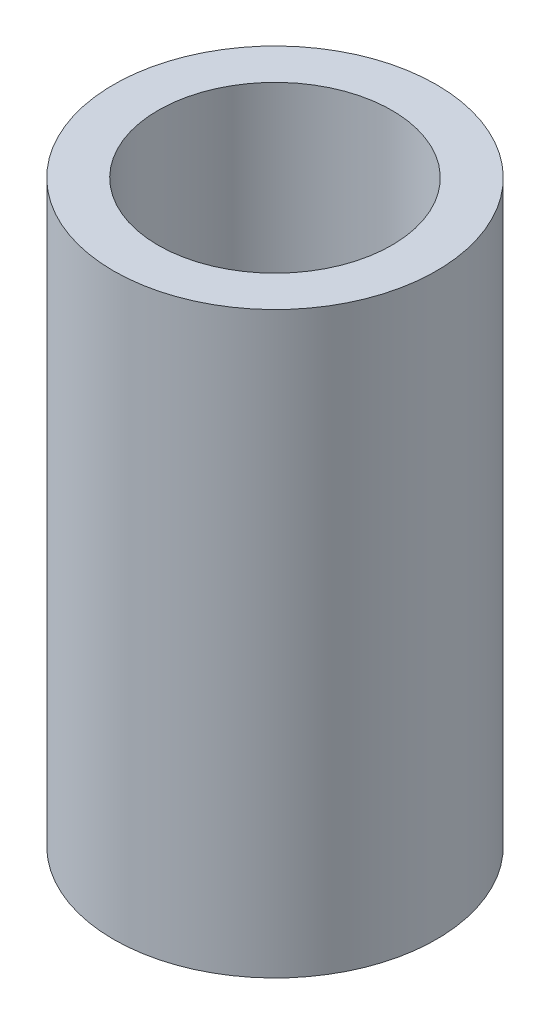
ISO-10303-21;
HEADER;
FILE_DESCRIPTION(('STEP AP214'),'2;1');
FILE_NAME('part.step','',(''),(''),'','','');
FILE_SCHEMA(('AUTOMOTIVE_DESIGN { 1 0 10303 214 1 1 1 1 }'));
ENDSEC;
DATA;
#1=APPLICATION_CONTEXT('core data for automotive mechanical design processes');
#2=APPLICATION_PROTOCOL_DEFINITION('international standard','automotive_design',2000,#1);
#3=PRODUCT_CONTEXT('',#1,'mechanical');
#4=PRODUCT('Part','Part','',(#3));
#5=PRODUCT_RELATED_PRODUCT_CATEGORY('part','',(#4));
#6=PRODUCT_DEFINITION_FORMATION('','',#4);
#7=PRODUCT_DEFINITION_CONTEXT('part definition',#1,'design');
#8=PRODUCT_DEFINITION('design','',#6,#7);
#9=PRODUCT_DEFINITION_SHAPE('','',#8);
#10=(LENGTH_UNIT() NAMED_UNIT(*) SI_UNIT(.MILLI.,.METRE.));
#11=(NAMED_UNIT(*) PLANE_ANGLE_UNIT() SI_UNIT($,.RADIAN.));
#12=(NAMED_UNIT(*) SI_UNIT($,.STERADIAN.) SOLID_ANGLE_UNIT());
#13=UNCERTAINTY_MEASURE_WITH_UNIT(LENGTH_MEASURE(1.E-05),#10,'distance_accuracy_value','');
#14=(GEOMETRIC_REPRESENTATION_CONTEXT(3) GLOBAL_UNCERTAINTY_ASSIGNED_CONTEXT((#13)) GLOBAL_UNIT_ASSIGNED_CONTEXT((#10,
#11,#12)) REPRESENTATION_CONTEXT('',''));
#15=CARTESIAN_POINT('',(0.,0.,0.));
#16=DIRECTION('',(0.,0.,1.));
#17=DIRECTION('',(1.,0.,0.));
#18=AXIS2_PLACEMENT_3D('',#15,#16,#17);
#19=CARTESIAN_POINT('',(0.,26.,0.));
#20=DIRECTION('',(0.,1.,0.));
#21=DIRECTION('',(0.,0.,1.));
#22=AXIS2_PLACEMENT_3D('',#19,#20,#21);
#23=PLANE('',#22);
#24=CARTESIAN_POINT('',(0.,26.,0.));
#25=DIRECTION('',(0.,1.,0.));
#26=DIRECTION('',(0.,0.,1.));
#27=AXIS2_PLACEMENT_3D('',#24,#25,#26);
#28=CIRCLE('',#27,7.25);
#29=CARTESIAN_POINT('',(0.,26.,7.25));
#30=VERTEX_POINT('',#29);
#31=EDGE_CURVE('E10',#30,#30,#28,.T.);
#32=ORIENTED_EDGE('',*,*,#31,.T.);
#33=EDGE_LOOP('',(#32));
#34=FACE_BOUND('',#33,.T.);
#35=CARTESIAN_POINT('',(0.,26.,0.));
#36=DIRECTION('',(0.,1.,0.));
#37=DIRECTION('',(0.,0.,1.));
#38=AXIS2_PLACEMENT_3D('',#35,#36,#37);
#39=CIRCLE('',#38,5.25);
#40=CARTESIAN_POINT('',(0.,26.,5.25));
#41=VERTEX_POINT('',#40);
#42=EDGE_CURVE('E41',#41,#41,#39,.T.);
#43=ORIENTED_EDGE('',*,*,#42,.F.);
#44=EDGE_LOOP('',(#43));
#45=FACE_BOUND('',#44,.T.);
#46=ADVANCED_FACE('F30',(#34,#45),#23,.T.);
#47=CARTESIAN_POINT('',(0.,0.,0.));
#48=DIRECTION('',(0.,1.,0.));
#49=DIRECTION('',(0.,0.,1.));
#50=AXIS2_PLACEMENT_3D('',#47,#48,#49);
#51=PLANE('',#50);
#52=CARTESIAN_POINT('',(0.,0.,0.));
#53=DIRECTION('',(0.,1.,0.));
#54=DIRECTION('',(0.,0.,1.));
#55=AXIS2_PLACEMENT_3D('',#52,#53,#54);
#56=CIRCLE('',#55,7.25);
#57=CARTESIAN_POINT('',(0.,0.,7.25));
#58=VERTEX_POINT('',#57);
#59=EDGE_CURVE('E34',#58,#58,#56,.T.);
#60=ORIENTED_EDGE('',*,*,#59,.F.);
#61=EDGE_LOOP('',(#60));
#62=FACE_BOUND('',#61,.T.);
#63=CARTESIAN_POINT('',(0.,0.,0.));
#64=DIRECTION('',(0.,1.,0.));
#65=DIRECTION('',(0.,0.,1.));
#66=AXIS2_PLACEMENT_3D('',#63,#64,#65);
#67=CIRCLE('',#66,5.25);
#68=CARTESIAN_POINT('',(0.,0.,5.25));
#69=VERTEX_POINT('',#68);
#70=EDGE_CURVE('E43',#69,#69,#67,.T.);
#71=ORIENTED_EDGE('',*,*,#70,.T.);
#72=EDGE_LOOP('',(#71));
#73=FACE_BOUND('',#72,.T.);
#74=ADVANCED_FACE('F53',(#62,#73),#51,.F.);
#75=CARTESIAN_POINT('',(0.,26.,0.));
#76=DIRECTION('',(0.,-1.,0.));
#77=DIRECTION('',(0.,0.,-1.));
#78=AXIS2_PLACEMENT_3D('',#75,#76,#77);
#79=CYLINDRICAL_SURFACE('',#78,7.25);
#80=ORIENTED_EDGE('',*,*,#31,.F.);
#81=EDGE_LOOP('',(#80));
#82=FACE_BOUND('',#81,.T.);
#83=ORIENTED_EDGE('',*,*,#59,.T.);
#84=EDGE_LOOP('',(#83));
#85=FACE_BOUND('',#84,.T.);
#86=ADVANCED_FACE('F32',(#82,#85),#79,.T.);
#87=CARTESIAN_POINT('',(0.,26.,0.));
#88=DIRECTION('',(0.,-1.,0.));
#89=DIRECTION('',(0.,0.,-1.));
#90=AXIS2_PLACEMENT_3D('',#87,#88,#89);
#91=CYLINDRICAL_SURFACE('',#90,5.25);
#92=ORIENTED_EDGE('',*,*,#42,.T.);
#93=EDGE_LOOP('',(#92));
#94=FACE_BOUND('',#93,.T.);
#95=ORIENTED_EDGE('',*,*,#70,.F.);
#96=EDGE_LOOP('',(#95));
#97=FACE_BOUND('',#96,.T.);
#98=ADVANCED_FACE('F49',(#94,#97),#91,.F.);
#99=CLOSED_SHELL('',(#46,#74,#86,#98));
#100=MANIFOLD_SOLID_BREP('B2',#99);
#101=ADVANCED_BREP_SHAPE_REPRESENTATION('',(#18,#100),#14);
#102=SHAPE_DEFINITION_REPRESENTATION(#9,#101);
ENDSEC;
END-ISO-10303-21;
